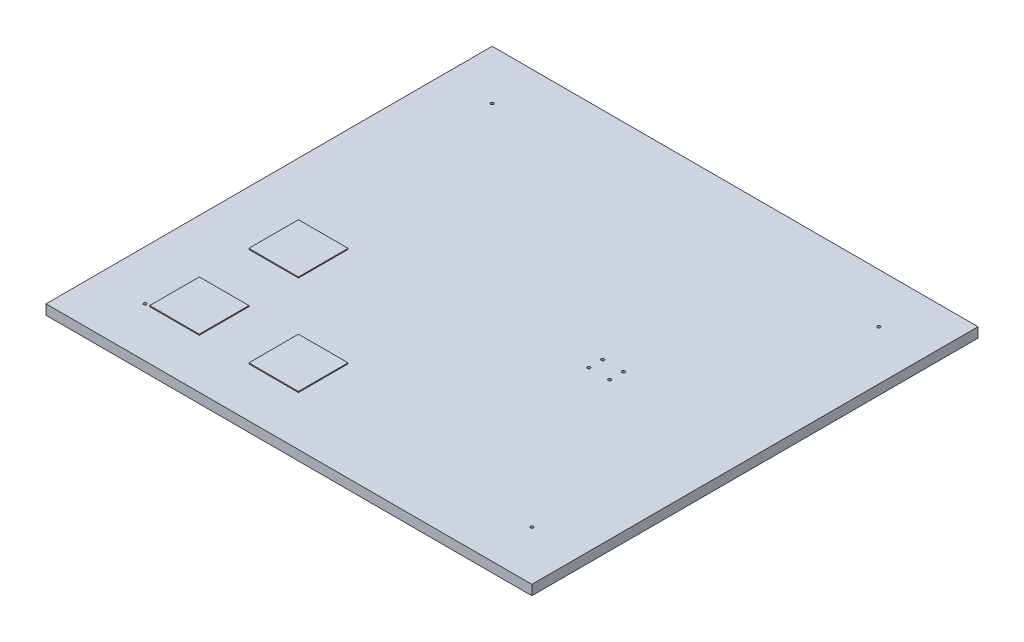
ISO-10303-21;
HEADER;
FILE_DESCRIPTION(('STEP AP214'),'2;1');
FILE_NAME('part.step','',(''),(''),'','','');
FILE_SCHEMA(('AUTOMOTIVE_DESIGN { 1 0 10303 214 1 1 1 1 }'));
ENDSEC;
DATA;
#1=APPLICATION_CONTEXT('core data for automotive mechanical design processes');
#2=APPLICATION_PROTOCOL_DEFINITION('international standard','automotive_design',2000,#1);
#3=PRODUCT_CONTEXT('',#1,'mechanical');
#4=PRODUCT('Part','Part','',(#3));
#5=PRODUCT_RELATED_PRODUCT_CATEGORY('part','',(#4));
#6=PRODUCT_DEFINITION_FORMATION('','',#4);
#7=PRODUCT_DEFINITION_CONTEXT('part definition',#1,'design');
#8=PRODUCT_DEFINITION('design','',#6,#7);
#9=PRODUCT_DEFINITION_SHAPE('','',#8);
#10=(LENGTH_UNIT() NAMED_UNIT(*) SI_UNIT(.MILLI.,.METRE.));
#11=(NAMED_UNIT(*) PLANE_ANGLE_UNIT() SI_UNIT($,.RADIAN.));
#12=(NAMED_UNIT(*) SI_UNIT($,.STERADIAN.) SOLID_ANGLE_UNIT());
#13=UNCERTAINTY_MEASURE_WITH_UNIT(LENGTH_MEASURE(1.E-05),#10,'distance_accuracy_value','');
#14=(GEOMETRIC_REPRESENTATION_CONTEXT(3) GLOBAL_UNCERTAINTY_ASSIGNED_CONTEXT((#13)) GLOBAL_UNIT_ASSIGNED_CONTEXT((#10,
#11,#12)) REPRESENTATION_CONTEXT('',''));
#15=CARTESIAN_POINT('',(0.,0.,0.));
#16=DIRECTION('',(0.,0.,1.));
#17=DIRECTION('',(1.,0.,0.));
#18=AXIS2_PLACEMENT_3D('',#15,#16,#17);
#19=CARTESIAN_POINT('',(195.,0.,175.));
#20=DIRECTION('',(0.,1.,0.));
#21=DIRECTION('',(0.,0.,1.));
#22=AXIS2_PLACEMENT_3D('',#19,#20,#21);
#23=CYLINDRICAL_SURFACE('',#22,1.5);
#24=CARTESIAN_POINT('',(195.,0.,175.));
#25=DIRECTION('',(0.,1.,0.));
#26=DIRECTION('',(0.,0.,1.));
#27=AXIS2_PLACEMENT_3D('',#24,#25,#26);
#28=CIRCLE('',#27,1.5);
#29=CARTESIAN_POINT('',(195.,0.,173.5));
#30=VERTEX_POINT('',#29);
#31=EDGE_CURVE('E282',#30,#30,#28,.T.);
#32=ORIENTED_EDGE('',*,*,#31,.F.);
#33=DIRECTION('',(0.,1.,0.));
#34=VECTOR('',#33,1.);
#35=CARTESIAN_POINT('',(195.,0.,173.5));
#36=LINE('',#35,#34);
#37=CARTESIAN_POINT('',(195.,10.,173.5));
#38=VERTEX_POINT('',#37);
#39=EDGE_CURVE('E11',#30,#38,#36,.T.);
#40=ORIENTED_EDGE('',*,*,#39,.T.);
#41=CARTESIAN_POINT('',(195.,10.,175.));
#42=DIRECTION('',(0.,-1.,0.));
#43=DIRECTION('',(0.,0.,1.));
#44=AXIS2_PLACEMENT_3D('',#41,#42,#43);
#45=CIRCLE('',#44,1.5);
#46=EDGE_CURVE('E372',#38,#38,#45,.T.);
#47=ORIENTED_EDGE('',*,*,#46,.F.);
#48=ORIENTED_EDGE('',*,*,#39,.F.);
#49=EDGE_LOOP('',(#32,#40,#47,#48));
#50=FACE_BOUND('',#49,.T.);
#51=ADVANCED_FACE('F18',(#50),#23,.F.);
#52=CARTESIAN_POINT('',(195.,0.,-175.));
#53=DIRECTION('',(0.,1.,0.));
#54=DIRECTION('',(0.,0.,1.));
#55=AXIS2_PLACEMENT_3D('',#52,#53,#54);
#56=CYLINDRICAL_SURFACE('',#55,1.5);
#57=CARTESIAN_POINT('',(195.,0.,-175.));
#58=DIRECTION('',(0.,1.,0.));
#59=DIRECTION('',(0.,0.,1.));
#60=AXIS2_PLACEMENT_3D('',#57,#58,#59);
#61=CIRCLE('',#60,1.5);
#62=CARTESIAN_POINT('',(195.,0.,-176.5));
#63=VERTEX_POINT('',#62);
#64=EDGE_CURVE('E278',#63,#63,#61,.T.);
#65=ORIENTED_EDGE('',*,*,#64,.F.);
#66=DIRECTION('',(0.,1.,0.));
#67=VECTOR('',#66,1.);
#68=CARTESIAN_POINT('',(195.,0.,-176.5));
#69=LINE('',#68,#67);
#70=CARTESIAN_POINT('',(195.,10.,-176.5));
#71=VERTEX_POINT('',#70);
#72=EDGE_CURVE('E26',#63,#71,#69,.T.);
#73=ORIENTED_EDGE('',*,*,#72,.T.);
#74=CARTESIAN_POINT('',(195.,10.,-175.));
#75=DIRECTION('',(0.,-1.,0.));
#76=DIRECTION('',(0.,0.,1.));
#77=AXIS2_PLACEMENT_3D('',#74,#75,#76);
#78=CIRCLE('',#77,1.5);
#79=EDGE_CURVE('E367',#71,#71,#78,.T.);
#80=ORIENTED_EDGE('',*,*,#79,.F.);
#81=ORIENTED_EDGE('',*,*,#72,.F.);
#82=EDGE_LOOP('',(#65,#73,#80,#81));
#83=FACE_BOUND('',#82,.T.);
#84=ADVANCED_FACE('F539',(#83),#56,.F.);
#85=CARTESIAN_POINT('',(-195.,0.,175.));
#86=DIRECTION('',(0.,1.,0.));
#87=DIRECTION('',(0.,0.,1.));
#88=AXIS2_PLACEMENT_3D('',#85,#86,#87);
#89=CYLINDRICAL_SURFACE('',#88,1.5);
#90=CARTESIAN_POINT('',(-195.,0.,175.));
#91=DIRECTION('',(0.,1.,0.));
#92=DIRECTION('',(0.,0.,1.));
#93=AXIS2_PLACEMENT_3D('',#90,#91,#92);
#94=CIRCLE('',#93,1.5);
#95=CARTESIAN_POINT('',(-195.,0.,173.5));
#96=VERTEX_POINT('',#95);
#97=EDGE_CURVE('E281',#96,#96,#94,.T.);
#98=ORIENTED_EDGE('',*,*,#97,.F.);
#99=DIRECTION('',(0.,1.,0.));
#100=VECTOR('',#99,1.);
#101=CARTESIAN_POINT('',(-195.,0.,173.5));
#102=LINE('',#101,#100);
#103=CARTESIAN_POINT('',(-195.,10.,173.5));
#104=VERTEX_POINT('',#103);
#105=EDGE_CURVE('E38',#96,#104,#102,.T.);
#106=ORIENTED_EDGE('',*,*,#105,.T.);
#107=CARTESIAN_POINT('',(-195.,10.,175.));
#108=DIRECTION('',(0.,-1.,0.));
#109=DIRECTION('',(0.,0.,1.));
#110=AXIS2_PLACEMENT_3D('',#107,#108,#109);
#111=CIRCLE('',#110,1.5);
#112=EDGE_CURVE('E371',#104,#104,#111,.T.);
#113=ORIENTED_EDGE('',*,*,#112,.F.);
#114=ORIENTED_EDGE('',*,*,#105,.F.);
#115=EDGE_LOOP('',(#98,#106,#113,#114));
#116=FACE_BOUND('',#115,.T.);
#117=ADVANCED_FACE('F545',(#116),#89,.F.);
#118=CARTESIAN_POINT('',(0.,0.,0.));
#119=DIRECTION('',(0.,1.,0.));
#120=DIRECTION('',(1.,0.,0.));
#121=AXIS2_PLACEMENT_3D('',#118,#119,#120);
#122=PLANE('',#121);
#123=CARTESIAN_POINT('',(105.5275,0.,7.));
#124=DIRECTION('',(0.,1.,0.));
#125=DIRECTION('',(-1.,0.,0.));
#126=AXIS2_PLACEMENT_3D('',#123,#124,#125);
#127=CIRCLE('',#126,1.5);
#128=CARTESIAN_POINT('',(107.0275,0.,7.));
#129=VERTEX_POINT('',#128);
#130=EDGE_CURVE('E461',#129,#129,#127,.T.);
#131=ORIENTED_EDGE('',*,*,#130,.T.);
#132=EDGE_LOOP('',(#131));
#133=FACE_BOUND('',#132,.T.);
#134=CARTESIAN_POINT('',(84.4725,0.,7.));
#135=DIRECTION('',(0.,1.,0.));
#136=DIRECTION('',(-1.,0.,0.));
#137=AXIS2_PLACEMENT_3D('',#134,#135,#136);
#138=CIRCLE('',#137,1.5);
#139=CARTESIAN_POINT('',(85.9725,0.,7.));
#140=VERTEX_POINT('',#139);
#141=EDGE_CURVE('E288',#140,#140,#138,.T.);
#142=ORIENTED_EDGE('',*,*,#141,.T.);
#143=EDGE_LOOP('',(#142));
#144=FACE_BOUND('',#143,.T.);
#145=CARTESIAN_POINT('',(105.5275,0.,-7.));
#146=DIRECTION('',(0.,1.,0.));
#147=DIRECTION('',(-1.,0.,0.));
#148=AXIS2_PLACEMENT_3D('',#145,#146,#147);
#149=CIRCLE('',#148,1.5);
#150=CARTESIAN_POINT('',(107.0275,0.,-7.));
#151=VERTEX_POINT('',#150);
#152=EDGE_CURVE('E304',#151,#151,#149,.T.);
#153=ORIENTED_EDGE('',*,*,#152,.T.);
#154=EDGE_LOOP('',(#153));
#155=FACE_BOUND('',#154,.T.);
#156=CARTESIAN_POINT('',(84.4725,0.,-7.));
#157=DIRECTION('',(0.,1.,0.));
#158=DIRECTION('',(-1.,0.,0.));
#159=AXIS2_PLACEMENT_3D('',#156,#157,#158);
#160=CIRCLE('',#159,1.5);
#161=CARTESIAN_POINT('',(85.9725,0.,-7.));
#162=VERTEX_POINT('',#161);
#163=EDGE_CURVE('E321',#162,#162,#160,.T.);
#164=ORIENTED_EDGE('',*,*,#163,.T.);
#165=EDGE_LOOP('',(#164));
#166=FACE_BOUND('',#165,.T.);
#167=CARTESIAN_POINT('',(-195.,0.,-175.));
#168=DIRECTION('',(0.,1.,0.));
#169=DIRECTION('',(0.,0.,1.));
#170=AXIS2_PLACEMENT_3D('',#167,#168,#169);
#171=CIRCLE('',#170,1.5);
#172=CARTESIAN_POINT('',(-195.,0.,-176.5));
#173=VERTEX_POINT('',#172);
#174=EDGE_CURVE('E420',#173,#173,#171,.T.);
#175=ORIENTED_EDGE('',*,*,#174,.T.);
#176=EDGE_LOOP('',(#175));
#177=FACE_BOUND('',#176,.T.);
#178=ORIENTED_EDGE('',*,*,#97,.T.);
#179=EDGE_LOOP('',(#178));
#180=FACE_BOUND('',#179,.T.);
#181=ORIENTED_EDGE('',*,*,#64,.T.);
#182=EDGE_LOOP('',(#181));
#183=FACE_BOUND('',#182,.T.);
#184=ORIENTED_EDGE('',*,*,#31,.T.);
#185=EDGE_LOOP('',(#184));
#186=FACE_BOUND('',#185,.T.);
#187=DIRECTION('',(0.,0.,-1.));
#188=VECTOR('',#187,1.);
#189=CARTESIAN_POINT('',(245.,0.,225.));
#190=LINE('',#189,#188);
#191=CARTESIAN_POINT('',(245.,0.,225.));
#192=VERTEX_POINT('',#191);
#193=CARTESIAN_POINT('',(245.,0.,-225.));
#194=VERTEX_POINT('',#193);
#195=EDGE_CURVE('E334',#192,#194,#190,.T.);
#196=ORIENTED_EDGE('',*,*,#195,.F.);
#197=DIRECTION('',(1.,0.,0.));
#198=VECTOR('',#197,1.);
#199=CARTESIAN_POINT('',(-245.,0.,225.));
#200=LINE('',#199,#198);
#201=CARTESIAN_POINT('',(-245.,0.,225.));
#202=VERTEX_POINT('',#201);
#203=EDGE_CURVE('E406',#202,#192,#200,.T.);
#204=ORIENTED_EDGE('',*,*,#203,.F.);
#205=DIRECTION('',(0.,0.,1.));
#206=VECTOR('',#205,1.);
#207=CARTESIAN_POINT('',(-245.,0.,-225.));
#208=LINE('',#207,#206);
#209=CARTESIAN_POINT('',(-245.,0.,-225.));
#210=VERTEX_POINT('',#209);
#211=EDGE_CURVE('E457',#210,#202,#208,.T.);
#212=ORIENTED_EDGE('',*,*,#211,.F.);
#213=DIRECTION('',(-1.,0.,0.));
#214=VECTOR('',#213,1.);
#215=CARTESIAN_POINT('',(245.,0.,-225.));
#216=LINE('',#215,#214);
#217=EDGE_CURVE('E356',#194,#210,#216,.T.);
#218=ORIENTED_EDGE('',*,*,#217,.F.);
#219=EDGE_LOOP('',(#196,#204,#212,#218));
#220=FACE_BOUND('',#219,.T.);
#221=ADVANCED_FACE('F492',(#133,#144,#155,#166,#177,#180,#183,#186,#220),#122,.F.);
#222=CARTESIAN_POINT('',(0.,10.,0.));
#223=DIRECTION('',(0.,1.,0.));
#224=DIRECTION('',(1.,0.,0.));
#225=AXIS2_PLACEMENT_3D('',#222,#223,#224);
#226=PLANE('',#225);
#227=CARTESIAN_POINT('',(105.5275,10.,7.));
#228=DIRECTION('',(0.,-1.,0.));
#229=DIRECTION('',(-1.,0.,0.));
#230=AXIS2_PLACEMENT_3D('',#227,#228,#229);
#231=CIRCLE('',#230,1.5);
#232=CARTESIAN_POINT('',(107.0275,10.,7.));
#233=VERTEX_POINT('',#232);
#234=EDGE_CURVE('E283',#233,#233,#231,.T.);
#235=ORIENTED_EDGE('',*,*,#234,.T.);
#236=EDGE_LOOP('',(#235));
#237=FACE_BOUND('',#236,.T.);
#238=CARTESIAN_POINT('',(84.4725,10.,7.));
#239=DIRECTION('',(0.,-1.,0.));
#240=DIRECTION('',(-1.,0.,0.));
#241=AXIS2_PLACEMENT_3D('',#238,#239,#240);
#242=CIRCLE('',#241,1.5);
#243=CARTESIAN_POINT('',(85.9725,10.,7.));
#244=VERTEX_POINT('',#243);
#245=EDGE_CURVE('E431',#244,#244,#242,.T.);
#246=ORIENTED_EDGE('',*,*,#245,.T.);
#247=EDGE_LOOP('',(#246));
#248=FACE_BOUND('',#247,.T.);
#249=CARTESIAN_POINT('',(105.5275,10.,-7.));
#250=DIRECTION('',(0.,-1.,0.));
#251=DIRECTION('',(-1.,0.,0.));
#252=AXIS2_PLACEMENT_3D('',#249,#250,#251);
#253=CIRCLE('',#252,1.5);
#254=CARTESIAN_POINT('',(107.0275,10.,-7.));
#255=VERTEX_POINT('',#254);
#256=EDGE_CURVE('E305',#255,#255,#253,.T.);
#257=ORIENTED_EDGE('',*,*,#256,.T.);
#258=EDGE_LOOP('',(#257));
#259=FACE_BOUND('',#258,.T.);
#260=CARTESIAN_POINT('',(84.4725,10.,-7.));
#261=DIRECTION('',(0.,-1.,0.));
#262=DIRECTION('',(-1.,0.,0.));
#263=AXIS2_PLACEMENT_3D('',#260,#261,#262);
#264=CIRCLE('',#263,1.5);
#265=CARTESIAN_POINT('',(85.9725,10.,-7.));
#266=VERTEX_POINT('',#265);
#267=EDGE_CURVE('E322',#266,#266,#264,.T.);
#268=ORIENTED_EDGE('',*,*,#267,.T.);
#269=EDGE_LOOP('',(#268));
#270=FACE_BOUND('',#269,.T.);
#271=CARTESIAN_POINT('',(-195.,10.,-175.));
#272=DIRECTION('',(0.,-1.,0.));
#273=DIRECTION('',(0.,0.,1.));
#274=AXIS2_PLACEMENT_3D('',#271,#272,#273);
#275=CIRCLE('',#274,1.5);
#276=CARTESIAN_POINT('',(-195.,10.,-176.5));
#277=VERTEX_POINT('',#276);
#278=EDGE_CURVE('E428',#277,#277,#275,.T.);
#279=ORIENTED_EDGE('',*,*,#278,.T.);
#280=EDGE_LOOP('',(#279));
#281=FACE_BOUND('',#280,.T.);
#282=ORIENTED_EDGE('',*,*,#112,.T.);
#283=EDGE_LOOP('',(#282));
#284=FACE_BOUND('',#283,.T.);
#285=ORIENTED_EDGE('',*,*,#79,.T.);
#286=EDGE_LOOP('',(#285));
#287=FACE_BOUND('',#286,.T.);
#288=ORIENTED_EDGE('',*,*,#46,.T.);
#289=EDGE_LOOP('',(#288));
#290=FACE_BOUND('',#289,.T.);
#291=DIRECTION('',(0.,0.,-1.));
#292=VECTOR('',#291,1.);
#293=CARTESIAN_POINT('',(-190.194892813262,10.,12.5973917508799));
#294=LINE('',#293,#292);
#295=CARTESIAN_POINT('',(-190.194892813262,10.,75.1947835017598));
#296=VERTEX_POINT('',#295);
#297=CARTESIAN_POINT('',(-190.194892813262,10.,25.1947835017598));
#298=VERTEX_POINT('',#297);
#299=EDGE_CURVE('E382',#296,#298,#294,.T.);
#300=ORIENTED_EDGE('',*,*,#299,.T.);
#301=DIRECTION('',(1.,0.,0.));
#302=VECTOR('',#301,1.);
#303=CARTESIAN_POINT('',(-70.097446406631,10.,25.1947835017598));
#304=LINE('',#303,#302);
#305=CARTESIAN_POINT('',(-140.194892813262,10.,25.1947835017598));
#306=VERTEX_POINT('',#305);
#307=EDGE_CURVE('E306',#298,#306,#304,.T.);
#308=ORIENTED_EDGE('',*,*,#307,.T.);
#309=DIRECTION('',(0.,0.,1.));
#310=VECTOR('',#309,1.);
#311=CARTESIAN_POINT('',(-140.194892813262,10.,37.5973917508799));
#312=LINE('',#311,#310);
#313=CARTESIAN_POINT('',(-140.194892813262,10.,75.1947835017598));
#314=VERTEX_POINT('',#313);
#315=EDGE_CURVE('E400',#306,#314,#312,.T.);
#316=ORIENTED_EDGE('',*,*,#315,.T.);
#317=DIRECTION('',(-1.,0.,0.));
#318=VECTOR('',#317,1.);
#319=CARTESIAN_POINT('',(-95.097446406631,10.,75.1947835017598));
#320=LINE('',#319,#318);
#321=EDGE_CURVE('E414',#314,#296,#320,.T.);
#322=ORIENTED_EDGE('',*,*,#321,.T.);
#323=EDGE_LOOP('',(#300,#308,#316,#322));
#324=FACE_BOUND('',#323,.T.);
#325=DIRECTION('',(1.,0.,0.));
#326=VECTOR('',#325,1.);
#327=CARTESIAN_POINT('',(-70.0974464066311,10.,125.19478350176));
#328=LINE('',#327,#326);
#329=CARTESIAN_POINT('',(-190.194892813262,10.,125.19478350176));
#330=VERTEX_POINT('',#329);
#331=CARTESIAN_POINT('',(-140.194892813262,10.,125.19478350176));
#332=VERTEX_POINT('',#331);
#333=EDGE_CURVE('E331',#330,#332,#328,.T.);
#334=ORIENTED_EDGE('',*,*,#333,.T.);
#335=DIRECTION('',(0.,0.,1.));
#336=VECTOR('',#335,1.);
#337=CARTESIAN_POINT('',(-140.194892813262,10.,87.5973917508799));
#338=LINE('',#337,#336);
#339=CARTESIAN_POINT('',(-140.194892813262,10.,175.19478350176));
#340=VERTEX_POINT('',#339);
#341=EDGE_CURVE('E349',#332,#340,#338,.T.);
#342=ORIENTED_EDGE('',*,*,#341,.T.);
#343=DIRECTION('',(-1.,0.,0.));
#344=VECTOR('',#343,1.);
#345=CARTESIAN_POINT('',(-95.0974464066311,10.,175.19478350176));
#346=LINE('',#345,#344);
#347=CARTESIAN_POINT('',(-190.194892813262,10.,175.19478350176));
#348=VERTEX_POINT('',#347);
#349=EDGE_CURVE('E289',#340,#348,#346,.T.);
#350=ORIENTED_EDGE('',*,*,#349,.T.);
#351=DIRECTION('',(0.,0.,-1.));
#352=VECTOR('',#351,1.);
#353=CARTESIAN_POINT('',(-190.194892813262,10.,62.5973917508799));
#354=LINE('',#353,#352);
#355=EDGE_CURVE('E376',#348,#330,#354,.T.);
#356=ORIENTED_EDGE('',*,*,#355,.T.);
#357=EDGE_LOOP('',(#334,#342,#350,#356));
#358=FACE_BOUND('',#357,.T.);
#359=DIRECTION('',(1.,0.,0.));
#360=VECTOR('',#359,1.);
#361=CARTESIAN_POINT('',(-20.0974464066311,10.,125.19478350176));
#362=LINE('',#361,#360);
#363=CARTESIAN_POINT('',(-90.1948928132621,10.,125.19478350176));
#364=VERTEX_POINT('',#363);
#365=CARTESIAN_POINT('',(-40.1948928132621,10.,125.19478350176));
#366=VERTEX_POINT('',#365);
#367=EDGE_CURVE('E239',#364,#366,#362,.T.);
#368=ORIENTED_EDGE('',*,*,#367,.T.);
#369=DIRECTION('',(0.,0.,1.));
#370=VECTOR('',#369,1.);
#371=CARTESIAN_POINT('',(-40.1948928132621,10.,87.5973917508799));
#372=LINE('',#371,#370);
#373=CARTESIAN_POINT('',(-40.1948928132621,10.,175.19478350176));
#374=VERTEX_POINT('',#373);
#375=EDGE_CURVE('E275',#366,#374,#372,.T.);
#376=ORIENTED_EDGE('',*,*,#375,.T.);
#377=DIRECTION('',(-1.,0.,0.));
#378=VECTOR('',#377,1.);
#379=CARTESIAN_POINT('',(-45.0974464066311,10.,175.19478350176));
#380=LINE('',#379,#378);
#381=CARTESIAN_POINT('',(-90.1948928132621,10.,175.19478350176));
#382=VERTEX_POINT('',#381);
#383=EDGE_CURVE('E240',#374,#382,#380,.T.);
#384=ORIENTED_EDGE('',*,*,#383,.T.);
#385=DIRECTION('',(0.,0.,-1.));
#386=VECTOR('',#385,1.);
#387=CARTESIAN_POINT('',(-90.1948928132621,10.,62.5973917508799));
#388=LINE('',#387,#386);
#389=EDGE_CURVE('E233',#382,#364,#388,.T.);
#390=ORIENTED_EDGE('',*,*,#389,.T.);
#391=EDGE_LOOP('',(#368,#376,#384,#390));
#392=FACE_BOUND('',#391,.T.);
#393=DIRECTION('',(0.,0.,-1.));
#394=VECTOR('',#393,1.);
#395=CARTESIAN_POINT('',(245.,10.,225.));
#396=LINE('',#395,#394);
#397=CARTESIAN_POINT('',(245.,10.,225.));
#398=VERTEX_POINT('',#397);
#399=CARTESIAN_POINT('',(245.,10.,-225.));
#400=VERTEX_POINT('',#399);
#401=EDGE_CURVE('E337',#398,#400,#396,.T.);
#402=ORIENTED_EDGE('',*,*,#401,.T.);
#403=DIRECTION('',(-1.,0.,0.));
#404=VECTOR('',#403,1.);
#405=CARTESIAN_POINT('',(245.,10.,-225.));
#406=LINE('',#405,#404);
#407=CARTESIAN_POINT('',(-245.,10.,-225.));
#408=VERTEX_POINT('',#407);
#409=EDGE_CURVE('E359',#400,#408,#406,.T.);
#410=ORIENTED_EDGE('',*,*,#409,.T.);
#411=DIRECTION('',(0.,0.,1.));
#412=VECTOR('',#411,1.);
#413=CARTESIAN_POINT('',(-245.,10.,-225.));
#414=LINE('',#413,#412);
#415=CARTESIAN_POINT('',(-245.,10.,225.));
#416=VERTEX_POINT('',#415);
#417=EDGE_CURVE('E474',#408,#416,#414,.T.);
#418=ORIENTED_EDGE('',*,*,#417,.T.);
#419=DIRECTION('',(1.,0.,0.));
#420=VECTOR('',#419,1.);
#421=CARTESIAN_POINT('',(-245.,10.,225.));
#422=LINE('',#421,#420);
#423=EDGE_CURVE('E405',#416,#398,#422,.T.);
#424=ORIENTED_EDGE('',*,*,#423,.T.);
#425=EDGE_LOOP('',(#402,#410,#418,#424));
#426=FACE_BOUND('',#425,.T.);
#427=ADVANCED_FACE('F235',(#237,#248,#259,#270,#281,#284,#287,#290,#324,#358,#392,#426),#226,.T.);
#428=CARTESIAN_POINT('',(245.,0.,225.));
#429=DIRECTION('',(1.,0.,0.));
#430=DIRECTION('',(0.,1.,0.));
#431=AXIS2_PLACEMENT_3D('',#428,#429,#430);
#432=PLANE('',#431);
#433=ORIENTED_EDGE('',*,*,#195,.T.);
#434=DIRECTION('',(0.,1.,0.));
#435=VECTOR('',#434,1.);
#436=CARTESIAN_POINT('',(245.,0.,-225.));
#437=LINE('',#436,#435);
#438=EDGE_CURVE('E338',#194,#400,#437,.T.);
#439=ORIENTED_EDGE('',*,*,#438,.T.);
#440=ORIENTED_EDGE('',*,*,#401,.F.);
#441=DIRECTION('',(0.,1.,0.));
#442=VECTOR('',#441,1.);
#443=CARTESIAN_POINT('',(245.,0.,225.));
#444=LINE('',#443,#442);
#445=EDGE_CURVE('E401',#192,#398,#444,.T.);
#446=ORIENTED_EDGE('',*,*,#445,.F.);
#447=EDGE_LOOP('',(#433,#439,#440,#446));
#448=FACE_BOUND('',#447,.T.);
#449=ADVANCED_FACE('F499',(#448),#432,.T.);
#450=CARTESIAN_POINT('',(245.,0.,-225.));
#451=DIRECTION('',(0.,0.,-1.));
#452=DIRECTION('',(0.,-1.,0.));
#453=AXIS2_PLACEMENT_3D('',#450,#451,#452);
#454=PLANE('',#453);
#455=ORIENTED_EDGE('',*,*,#217,.T.);
#456=DIRECTION('',(0.,1.,0.));
#457=VECTOR('',#456,1.);
#458=CARTESIAN_POINT('',(-245.,0.,-225.));
#459=LINE('',#458,#457);
#460=EDGE_CURVE('E360',#210,#408,#459,.T.);
#461=ORIENTED_EDGE('',*,*,#460,.T.);
#462=ORIENTED_EDGE('',*,*,#409,.F.);
#463=ORIENTED_EDGE('',*,*,#438,.F.);
#464=EDGE_LOOP('',(#455,#461,#462,#463));
#465=FACE_BOUND('',#464,.T.);
#466=ADVANCED_FACE('F552',(#465),#454,.T.);
#467=CARTESIAN_POINT('',(-245.,0.,-225.));
#468=DIRECTION('',(-1.,0.,0.));
#469=DIRECTION('',(0.,0.,1.));
#470=AXIS2_PLACEMENT_3D('',#467,#468,#469);
#471=PLANE('',#470);
#472=ORIENTED_EDGE('',*,*,#211,.T.);
#473=DIRECTION('',(0.,1.,0.));
#474=VECTOR('',#473,1.);
#475=CARTESIAN_POINT('',(-245.,0.,225.));
#476=LINE('',#475,#474);
#477=EDGE_CURVE('E453',#202,#416,#476,.T.);
#478=ORIENTED_EDGE('',*,*,#477,.T.);
#479=ORIENTED_EDGE('',*,*,#417,.F.);
#480=ORIENTED_EDGE('',*,*,#460,.F.);
#481=EDGE_LOOP('',(#472,#478,#479,#480));
#482=FACE_BOUND('',#481,.T.);
#483=ADVANCED_FACE('F555',(#482),#471,.T.);
#484=CARTESIAN_POINT('',(-245.,0.,225.));
#485=DIRECTION('',(0.,0.,1.));
#486=DIRECTION('',(1.,0.,0.));
#487=AXIS2_PLACEMENT_3D('',#484,#485,#486);
#488=PLANE('',#487);
#489=ORIENTED_EDGE('',*,*,#203,.T.);
#490=ORIENTED_EDGE('',*,*,#445,.T.);
#491=ORIENTED_EDGE('',*,*,#423,.F.);
#492=ORIENTED_EDGE('',*,*,#477,.F.);
#493=EDGE_LOOP('',(#489,#490,#491,#492));
#494=FACE_BOUND('',#493,.T.);
#495=ADVANCED_FACE('F559',(#494),#488,.T.);
#496=CARTESIAN_POINT('',(105.5275,10.,7.));
#497=DIRECTION('',(0.,-1.,0.));
#498=DIRECTION('',(-1.,0.,0.));
#499=AXIS2_PLACEMENT_3D('',#496,#497,#498);
#500=CYLINDRICAL_SURFACE('',#499,1.5);
#501=ORIENTED_EDGE('',*,*,#234,.F.);
#502=DIRECTION('',(0.,-1.,0.));
#503=VECTOR('',#502,1.);
#504=CARTESIAN_POINT('',(107.0275,10.,7.));
#505=LINE('',#504,#503);
#506=EDGE_CURVE('E287',#233,#129,#505,.T.);
#507=ORIENTED_EDGE('',*,*,#506,.T.);
#508=ORIENTED_EDGE('',*,*,#130,.F.);
#509=ORIENTED_EDGE('',*,*,#506,.F.);
#510=EDGE_LOOP('',(#501,#507,#508,#509));
#511=FACE_BOUND('',#510,.T.);
#512=ADVANCED_FACE('F563',(#511),#500,.F.);
#513=CARTESIAN_POINT('',(84.4725,10.,7.));
#514=DIRECTION('',(0.,-1.,0.));
#515=DIRECTION('',(-1.,0.,0.));
#516=AXIS2_PLACEMENT_3D('',#513,#514,#515);
#517=CYLINDRICAL_SURFACE('',#516,1.5);
#518=ORIENTED_EDGE('',*,*,#245,.F.);
#519=DIRECTION('',(0.,-1.,0.));
#520=VECTOR('',#519,1.);
#521=CARTESIAN_POINT('',(85.9725,10.,7.));
#522=LINE('',#521,#520);
#523=EDGE_CURVE('E445',#244,#140,#522,.T.);
#524=ORIENTED_EDGE('',*,*,#523,.T.);
#525=ORIENTED_EDGE('',*,*,#141,.F.);
#526=ORIENTED_EDGE('',*,*,#523,.F.);
#527=EDGE_LOOP('',(#518,#524,#525,#526));
#528=FACE_BOUND('',#527,.T.);
#529=ADVANCED_FACE('F570',(#528),#517,.F.);
#530=CARTESIAN_POINT('',(105.5275,10.,-7.));
#531=DIRECTION('',(0.,-1.,0.));
#532=DIRECTION('',(-1.,0.,0.));
#533=AXIS2_PLACEMENT_3D('',#530,#531,#532);
#534=CYLINDRICAL_SURFACE('',#533,1.5);
#535=ORIENTED_EDGE('',*,*,#256,.F.);
#536=DIRECTION('',(0.,-1.,0.));
#537=VECTOR('',#536,1.);
#538=CARTESIAN_POINT('',(107.0275,10.,-7.));
#539=LINE('',#538,#537);
#540=EDGE_CURVE('E300',#255,#151,#539,.T.);
#541=ORIENTED_EDGE('',*,*,#540,.T.);
#542=ORIENTED_EDGE('',*,*,#152,.F.);
#543=ORIENTED_EDGE('',*,*,#540,.F.);
#544=EDGE_LOOP('',(#535,#541,#542,#543));
#545=FACE_BOUND('',#544,.T.);
#546=ADVANCED_FACE('F574',(#545),#534,.F.);
#547=CARTESIAN_POINT('',(84.4725,10.,-7.));
#548=DIRECTION('',(0.,-1.,0.));
#549=DIRECTION('',(-1.,0.,0.));
#550=AXIS2_PLACEMENT_3D('',#547,#548,#549);
#551=CYLINDRICAL_SURFACE('',#550,1.5);
#552=ORIENTED_EDGE('',*,*,#267,.F.);
#553=DIRECTION('',(0.,-1.,0.));
#554=VECTOR('',#553,1.);
#555=CARTESIAN_POINT('',(85.9725,10.,-7.));
#556=LINE('',#555,#554);
#557=EDGE_CURVE('E317',#266,#162,#556,.T.);
#558=ORIENTED_EDGE('',*,*,#557,.T.);
#559=ORIENTED_EDGE('',*,*,#163,.F.);
#560=ORIENTED_EDGE('',*,*,#557,.F.);
#561=EDGE_LOOP('',(#552,#558,#559,#560));
#562=FACE_BOUND('',#561,.T.);
#563=ADVANCED_FACE('F578',(#562),#551,.F.);
#564=CARTESIAN_POINT('',(-195.,0.,-175.));
#565=DIRECTION('',(0.,1.,0.));
#566=DIRECTION('',(0.,0.,1.));
#567=AXIS2_PLACEMENT_3D('',#564,#565,#566);
#568=CYLINDRICAL_SURFACE('',#567,1.5);
#569=ORIENTED_EDGE('',*,*,#174,.F.);
#570=DIRECTION('',(0.,1.,0.));
#571=VECTOR('',#570,1.);
#572=CARTESIAN_POINT('',(-195.,0.,-176.5));
#573=LINE('',#572,#571);
#574=EDGE_CURVE('E424',#173,#277,#573,.T.);
#575=ORIENTED_EDGE('',*,*,#574,.T.);
#576=ORIENTED_EDGE('',*,*,#278,.F.);
#577=ORIENTED_EDGE('',*,*,#574,.F.);
#578=EDGE_LOOP('',(#569,#575,#576,#577));
#579=FACE_BOUND('',#578,.T.);
#580=ADVANCED_FACE('F585',(#579),#568,.F.);
#581=CARTESIAN_POINT('',(-165.194892813262,11.,50.1947835017598));
#582=DIRECTION('',(0.,1.,0.));
#583=DIRECTION('',(1.,0.,0.));
#584=AXIS2_PLACEMENT_3D('',#581,#582,#583);
#585=PLANE('',#584);
#586=DIRECTION('',(1.,0.,0.));
#587=VECTOR('',#586,1.);
#588=CARTESIAN_POINT('',(-190.194892813262,11.,75.1947835017598));
#589=LINE('',#588,#587);
#590=CARTESIAN_POINT('',(-190.194892813262,11.,75.1947835017598));
#591=VERTEX_POINT('',#590);
#592=CARTESIAN_POINT('',(-140.194892813262,11.,75.1947835017598));
#593=VERTEX_POINT('',#592);
#594=EDGE_CURVE('E417',#591,#593,#589,.T.);
#595=ORIENTED_EDGE('',*,*,#594,.T.);
#596=DIRECTION('',(0.,0.,-1.));
#597=VECTOR('',#596,1.);
#598=CARTESIAN_POINT('',(-140.194892813262,11.,75.1947835017598));
#599=LINE('',#598,#597);
#600=CARTESIAN_POINT('',(-140.194892813262,11.,25.1947835017598));
#601=VERTEX_POINT('',#600);
#602=EDGE_CURVE('E410',#593,#601,#599,.T.);
#603=ORIENTED_EDGE('',*,*,#602,.T.);
#604=DIRECTION('',(-1.,0.,0.));
#605=VECTOR('',#604,1.);
#606=CARTESIAN_POINT('',(-140.194892813262,11.,25.1947835017598));
#607=LINE('',#606,#605);
#608=CARTESIAN_POINT('',(-190.194892813262,11.,25.1947835017598));
#609=VERTEX_POINT('',#608);
#610=EDGE_CURVE('E310',#601,#609,#607,.T.);
#611=ORIENTED_EDGE('',*,*,#610,.T.);
#612=DIRECTION('',(0.,0.,1.));
#613=VECTOR('',#612,1.);
#614=CARTESIAN_POINT('',(-190.194892813262,11.,25.1947835017598));
#615=LINE('',#614,#613);
#616=EDGE_CURVE('E267',#609,#591,#615,.T.);
#617=ORIENTED_EDGE('',*,*,#616,.T.);
#618=EDGE_LOOP('',(#595,#603,#611,#617));
#619=FACE_BOUND('',#618,.T.);
#620=ADVANCED_FACE('F591',(#619),#585,.T.);
#621=CARTESIAN_POINT('',(-190.194892813262,10.,75.1947835017598));
#622=DIRECTION('',(0.,0.,1.));
#623=DIRECTION('',(1.,0.,0.));
#624=AXIS2_PLACEMENT_3D('',#621,#622,#623);
#625=PLANE('',#624);
#626=ORIENTED_EDGE('',*,*,#321,.F.);
#627=DIRECTION('',(0.,1.,0.));
#628=VECTOR('',#627,1.);
#629=CARTESIAN_POINT('',(-140.194892813262,10.,75.1947835017598));
#630=LINE('',#629,#628);
#631=EDGE_CURVE('E413',#314,#593,#630,.T.);
#632=ORIENTED_EDGE('',*,*,#631,.T.);
#633=ORIENTED_EDGE('',*,*,#594,.F.);
#634=DIRECTION('',(0.,1.,0.));
#635=VECTOR('',#634,1.);
#636=CARTESIAN_POINT('',(-190.194892813262,10.,75.1947835017598));
#637=LINE('',#636,#635);
#638=EDGE_CURVE('E388',#296,#591,#637,.T.);
#639=ORIENTED_EDGE('',*,*,#638,.F.);
#640=EDGE_LOOP('',(#626,#632,#633,#639));
#641=FACE_BOUND('',#640,.T.);
#642=ADVANCED_FACE('F587',(#641),#625,.T.);
#643=CARTESIAN_POINT('',(-140.194892813262,10.,75.1947835017598));
#644=DIRECTION('',(1.,0.,0.));
#645=DIRECTION('',(0.,0.,1.));
#646=AXIS2_PLACEMENT_3D('',#643,#644,#645);
#647=PLANE('',#646);
#648=ORIENTED_EDGE('',*,*,#315,.F.);
#649=DIRECTION('',(0.,1.,0.));
#650=VECTOR('',#649,1.);
#651=CARTESIAN_POINT('',(-140.194892813262,10.,25.1947835017598));
#652=LINE('',#651,#650);
#653=EDGE_CURVE('E396',#306,#601,#652,.T.);
#654=ORIENTED_EDGE('',*,*,#653,.T.);
#655=ORIENTED_EDGE('',*,*,#602,.F.);
#656=ORIENTED_EDGE('',*,*,#631,.F.);
#657=EDGE_LOOP('',(#648,#654,#655,#656));
#658=FACE_BOUND('',#657,.T.);
#659=ADVANCED_FACE('F590',(#658),#647,.T.);
#660=CARTESIAN_POINT('',(-140.194892813262,10.,25.1947835017598));
#661=DIRECTION('',(0.,0.,-1.));
#662=DIRECTION('',(0.,-1.,0.));
#663=AXIS2_PLACEMENT_3D('',#660,#661,#662);
#664=PLANE('',#663);
#665=ORIENTED_EDGE('',*,*,#307,.F.);
#666=DIRECTION('',(0.,1.,0.));
#667=VECTOR('',#666,1.);
#668=CARTESIAN_POINT('',(-190.194892813262,10.,25.1947835017598));
#669=LINE('',#668,#667);
#670=EDGE_CURVE('E311',#298,#609,#669,.T.);
#671=ORIENTED_EDGE('',*,*,#670,.T.);
#672=ORIENTED_EDGE('',*,*,#610,.F.);
#673=ORIENTED_EDGE('',*,*,#653,.F.);
#674=EDGE_LOOP('',(#665,#671,#672,#673));
#675=FACE_BOUND('',#674,.T.);
#676=ADVANCED_FACE('F533',(#675),#664,.T.);
#677=CARTESIAN_POINT('',(-190.194892813262,10.,25.1947835017598));
#678=DIRECTION('',(-1.,0.,0.));
#679=DIRECTION('',(0.,0.,1.));
#680=AXIS2_PLACEMENT_3D('',#677,#678,#679);
#681=PLANE('',#680);
#682=ORIENTED_EDGE('',*,*,#299,.F.);
#683=ORIENTED_EDGE('',*,*,#638,.T.);
#684=ORIENTED_EDGE('',*,*,#616,.F.);
#685=ORIENTED_EDGE('',*,*,#670,.F.);
#686=EDGE_LOOP('',(#682,#683,#684,#685));
#687=FACE_BOUND('',#686,.T.);
#688=ADVANCED_FACE('F523',(#687),#681,.T.);
#689=CARTESIAN_POINT('',(-165.194892813262,11.,150.19478350176));
#690=DIRECTION('',(0.,1.,0.));
#691=DIRECTION('',(1.,0.,0.));
#692=AXIS2_PLACEMENT_3D('',#689,#690,#691);
#693=PLANE('',#692);
#694=DIRECTION('',(0.,0.,1.));
#695=VECTOR('',#694,1.);
#696=CARTESIAN_POINT('',(-190.194892813262,11.,175.19478350176));
#697=LINE('',#696,#695);
#698=CARTESIAN_POINT('',(-190.194892813262,11.,125.19478350176));
#699=VERTEX_POINT('',#698);
#700=CARTESIAN_POINT('',(-190.194892813262,11.,175.19478350176));
#701=VERTEX_POINT('',#700);
#702=EDGE_CURVE('E379',#699,#701,#697,.T.);
#703=ORIENTED_EDGE('',*,*,#702,.T.);
#704=DIRECTION('',(1.,0.,0.));
#705=VECTOR('',#704,1.);
#706=CARTESIAN_POINT('',(-140.194892813262,11.,175.19478350176));
#707=LINE('',#706,#705);
#708=CARTESIAN_POINT('',(-140.194892813262,11.,175.19478350176));
#709=VERTEX_POINT('',#708);
#710=EDGE_CURVE('E293',#701,#709,#707,.T.);
#711=ORIENTED_EDGE('',*,*,#710,.T.);
#712=DIRECTION('',(0.,0.,-1.));
#713=VECTOR('',#712,1.);
#714=CARTESIAN_POINT('',(-140.194892813262,11.,125.19478350176));
#715=LINE('',#714,#713);
#716=CARTESIAN_POINT('',(-140.194892813262,11.,125.19478350176));
#717=VERTEX_POINT('',#716);
#718=EDGE_CURVE('E353',#709,#717,#715,.T.);
#719=ORIENTED_EDGE('',*,*,#718,.T.);
#720=DIRECTION('',(-1.,0.,0.));
#721=VECTOR('',#720,1.);
#722=CARTESIAN_POINT('',(-190.194892813262,11.,125.19478350176));
#723=LINE('',#722,#721);
#724=EDGE_CURVE('E330',#717,#699,#723,.T.);
#725=ORIENTED_EDGE('',*,*,#724,.T.);
#726=EDGE_LOOP('',(#703,#711,#719,#725));
#727=FACE_BOUND('',#726,.T.);
#728=ADVANCED_FACE('F521',(#727),#693,.T.);
#729=CARTESIAN_POINT('',(-190.194892813262,10.,125.19478350176));
#730=DIRECTION('',(-1.,0.,0.));
#731=DIRECTION('',(0.,0.,1.));
#732=AXIS2_PLACEMENT_3D('',#729,#730,#731);
#733=PLANE('',#732);
#734=ORIENTED_EDGE('',*,*,#355,.F.);
#735=DIRECTION('',(0.,1.,0.));
#736=VECTOR('',#735,1.);
#737=CARTESIAN_POINT('',(-190.194892813262,10.,175.19478350176));
#738=LINE('',#737,#736);
#739=EDGE_CURVE('E366',#348,#701,#738,.T.);
#740=ORIENTED_EDGE('',*,*,#739,.T.);
#741=ORIENTED_EDGE('',*,*,#702,.F.);
#742=DIRECTION('',(0.,1.,0.));
#743=VECTOR('',#742,1.);
#744=CARTESIAN_POINT('',(-190.194892813262,10.,125.19478350176));
#745=LINE('',#744,#743);
#746=EDGE_CURVE('E326',#330,#699,#745,.T.);
#747=ORIENTED_EDGE('',*,*,#746,.F.);
#748=EDGE_LOOP('',(#734,#740,#741,#747));
#749=FACE_BOUND('',#748,.T.);
#750=ADVANCED_FACE('F519',(#749),#733,.T.);
#751=CARTESIAN_POINT('',(-190.194892813262,10.,175.19478350176));
#752=DIRECTION('',(0.,0.,1.));
#753=DIRECTION('',(1.,0.,0.));
#754=AXIS2_PLACEMENT_3D('',#751,#752,#753);
#755=PLANE('',#754);
#756=ORIENTED_EDGE('',*,*,#349,.F.);
#757=DIRECTION('',(0.,1.,0.));
#758=VECTOR('',#757,1.);
#759=CARTESIAN_POINT('',(-140.194892813262,10.,175.19478350176));
#760=LINE('',#759,#758);
#761=EDGE_CURVE('E294',#340,#709,#760,.T.);
#762=ORIENTED_EDGE('',*,*,#761,.T.);
#763=ORIENTED_EDGE('',*,*,#710,.F.);
#764=ORIENTED_EDGE('',*,*,#739,.F.);
#765=EDGE_LOOP('',(#756,#762,#763,#764));
#766=FACE_BOUND('',#765,.T.);
#767=ADVANCED_FACE('F516',(#766),#755,.T.);
#768=CARTESIAN_POINT('',(-140.194892813262,10.,175.19478350176));
#769=DIRECTION('',(1.,0.,0.));
#770=DIRECTION('',(0.,0.,1.));
#771=AXIS2_PLACEMENT_3D('',#768,#769,#770);
#772=PLANE('',#771);
#773=ORIENTED_EDGE('',*,*,#341,.F.);
#774=DIRECTION('',(0.,1.,0.));
#775=VECTOR('',#774,1.);
#776=CARTESIAN_POINT('',(-140.194892813262,10.,125.19478350176));
#777=LINE('',#776,#775);
#778=EDGE_CURVE('E345',#332,#717,#777,.T.);
#779=ORIENTED_EDGE('',*,*,#778,.T.);
#780=ORIENTED_EDGE('',*,*,#718,.F.);
#781=ORIENTED_EDGE('',*,*,#761,.F.);
#782=EDGE_LOOP('',(#773,#779,#780,#781));
#783=FACE_BOUND('',#782,.T.);
#784=ADVANCED_FACE('F512',(#783),#772,.T.);
#785=CARTESIAN_POINT('',(-140.194892813262,10.,125.19478350176));
#786=DIRECTION('',(0.,0.,-1.));
#787=DIRECTION('',(0.,-1.,0.));
#788=AXIS2_PLACEMENT_3D('',#785,#786,#787);
#789=PLANE('',#788);
#790=ORIENTED_EDGE('',*,*,#333,.F.);
#791=ORIENTED_EDGE('',*,*,#746,.T.);
#792=ORIENTED_EDGE('',*,*,#724,.F.);
#793=ORIENTED_EDGE('',*,*,#778,.F.);
#794=EDGE_LOOP('',(#790,#791,#792,#793));
#795=FACE_BOUND('',#794,.T.);
#796=ADVANCED_FACE('F508',(#795),#789,.T.);
#797=CARTESIAN_POINT('',(-65.1948928132621,11.,150.19478350176));
#798=DIRECTION('',(0.,1.,0.));
#799=DIRECTION('',(1.,0.,0.));
#800=AXIS2_PLACEMENT_3D('',#797,#798,#799);
#801=PLANE('',#800);
#802=DIRECTION('',(0.,0.,1.));
#803=VECTOR('',#802,1.);
#804=CARTESIAN_POINT('',(-90.1948928132621,11.,175.19478350176));
#805=LINE('',#804,#803);
#806=CARTESIAN_POINT('',(-90.1948928132621,11.,125.19478350176));
#807=VERTEX_POINT('',#806);
#808=CARTESIAN_POINT('',(-90.1948928132621,11.,175.19478350176));
#809=VERTEX_POINT('',#808);
#810=EDGE_CURVE('E245',#807,#809,#805,.T.);
#811=ORIENTED_EDGE('',*,*,#810,.T.);
#812=DIRECTION('',(1.,0.,0.));
#813=VECTOR('',#812,1.);
#814=CARTESIAN_POINT('',(-40.1948928132621,11.,175.19478350176));
#815=LINE('',#814,#813);
#816=CARTESIAN_POINT('',(-40.1948928132621,11.,175.19478350176));
#817=VERTEX_POINT('',#816);
#818=EDGE_CURVE('E314',#809,#817,#815,.T.);
#819=ORIENTED_EDGE('',*,*,#818,.T.);
#820=DIRECTION('',(0.,0.,-1.));
#821=VECTOR('',#820,1.);
#822=CARTESIAN_POINT('',(-40.1948928132621,11.,125.19478350176));
#823=LINE('',#822,#821);
#824=CARTESIAN_POINT('',(-40.1948928132621,11.,125.19478350176));
#825=VERTEX_POINT('',#824);
#826=EDGE_CURVE('E271',#817,#825,#823,.T.);
#827=ORIENTED_EDGE('',*,*,#826,.T.);
#828=DIRECTION('',(-1.,0.,0.));
#829=VECTOR('',#828,1.);
#830=CARTESIAN_POINT('',(-90.1948928132621,11.,125.19478350176));
#831=LINE('',#830,#829);
#832=EDGE_CURVE('E255',#825,#807,#831,.T.);
#833=ORIENTED_EDGE('',*,*,#832,.T.);
#834=EDGE_LOOP('',(#811,#819,#827,#833));
#835=FACE_BOUND('',#834,.T.);
#836=ADVANCED_FACE('F796',(#835),#801,.T.);
#837=CARTESIAN_POINT('',(-90.1948928132621,10.,125.19478350176));
#838=DIRECTION('',(-1.,0.,0.));
#839=DIRECTION('',(0.,0.,1.));
#840=AXIS2_PLACEMENT_3D('',#837,#838,#839);
#841=PLANE('',#840);
#842=ORIENTED_EDGE('',*,*,#389,.F.);
#843=DIRECTION('',(0.,1.,0.));
#844=VECTOR('',#843,1.);
#845=CARTESIAN_POINT('',(-90.1948928132621,10.,175.19478350176));
#846=LINE('',#845,#844);
#847=EDGE_CURVE('E246',#382,#809,#846,.T.);
#848=ORIENTED_EDGE('',*,*,#847,.T.);
#849=ORIENTED_EDGE('',*,*,#810,.F.);
#850=DIRECTION('',(0.,1.,0.));
#851=VECTOR('',#850,1.);
#852=CARTESIAN_POINT('',(-90.1948928132621,10.,125.19478350176));
#853=LINE('',#852,#851);
#854=EDGE_CURVE('E249',#364,#807,#853,.T.);
#855=ORIENTED_EDGE('',*,*,#854,.F.);
#856=EDGE_LOOP('',(#842,#848,#849,#855));
#857=FACE_BOUND('',#856,.T.);
#858=ADVANCED_FACE('F250',(#857),#841,.T.);
#859=CARTESIAN_POINT('',(-90.1948928132621,10.,175.19478350176));
#860=DIRECTION('',(0.,0.,1.));
#861=DIRECTION('',(1.,0.,0.));
#862=AXIS2_PLACEMENT_3D('',#859,#860,#861);
#863=PLANE('',#862);
#864=ORIENTED_EDGE('',*,*,#383,.F.);
#865=DIRECTION('',(0.,1.,0.));
#866=VECTOR('',#865,1.);
#867=CARTESIAN_POINT('',(-40.1948928132621,10.,175.19478350176));
#868=LINE('',#867,#866);
#869=EDGE_CURVE('E274',#374,#817,#868,.T.);
#870=ORIENTED_EDGE('',*,*,#869,.T.);
#871=ORIENTED_EDGE('',*,*,#818,.F.);
#872=ORIENTED_EDGE('',*,*,#847,.F.);
#873=EDGE_LOOP('',(#864,#870,#871,#872));
#874=FACE_BOUND('',#873,.T.);
#875=ADVANCED_FACE('F791',(#874),#863,.T.);
#876=CARTESIAN_POINT('',(-40.1948928132621,10.,175.19478350176));
#877=DIRECTION('',(1.,0.,0.));
#878=DIRECTION('',(0.,0.,1.));
#879=AXIS2_PLACEMENT_3D('',#876,#877,#878);
#880=PLANE('',#879);
#881=ORIENTED_EDGE('',*,*,#375,.F.);
#882=DIRECTION('',(0.,1.,0.));
#883=VECTOR('',#882,1.);
#884=CARTESIAN_POINT('',(-40.1948928132621,10.,125.19478350176));
#885=LINE('',#884,#883);
#886=EDGE_CURVE('E260',#366,#825,#885,.T.);
#887=ORIENTED_EDGE('',*,*,#886,.T.);
#888=ORIENTED_EDGE('',*,*,#826,.F.);
#889=ORIENTED_EDGE('',*,*,#869,.F.);
#890=EDGE_LOOP('',(#881,#887,#888,#889));
#891=FACE_BOUND('',#890,.T.);
#892=ADVANCED_FACE('F762',(#891),#880,.T.);
#893=CARTESIAN_POINT('',(-40.1948928132621,10.,125.19478350176));
#894=DIRECTION('',(0.,0.,-1.));
#895=DIRECTION('',(0.,-1.,0.));
#896=AXIS2_PLACEMENT_3D('',#893,#894,#895);
#897=PLANE('',#896);
#898=ORIENTED_EDGE('',*,*,#367,.F.);
#899=ORIENTED_EDGE('',*,*,#854,.T.);
#900=ORIENTED_EDGE('',*,*,#832,.F.);
#901=ORIENTED_EDGE('',*,*,#886,.F.);
#902=EDGE_LOOP('',(#898,#899,#900,#901));
#903=FACE_BOUND('',#902,.T.);
#904=ADVANCED_FACE('F258',(#903),#897,.T.);
#905=CLOSED_SHELL('',(#51,#84,#117,#221,#427,#449,#466,#483,#495,#512,#529,#546,#563,#580,#620,
#642,#659,#676,#688,#728,#750,#767,#784,#796,#836,#858,#875,#892,#904));
#906=MANIFOLD_SOLID_BREP('B1',#905);
#907=ADVANCED_BREP_SHAPE_REPRESENTATION('',(#18,#906),#14);
#908=SHAPE_DEFINITION_REPRESENTATION(#9,#907);
ENDSEC;
END-ISO-10303-21;
